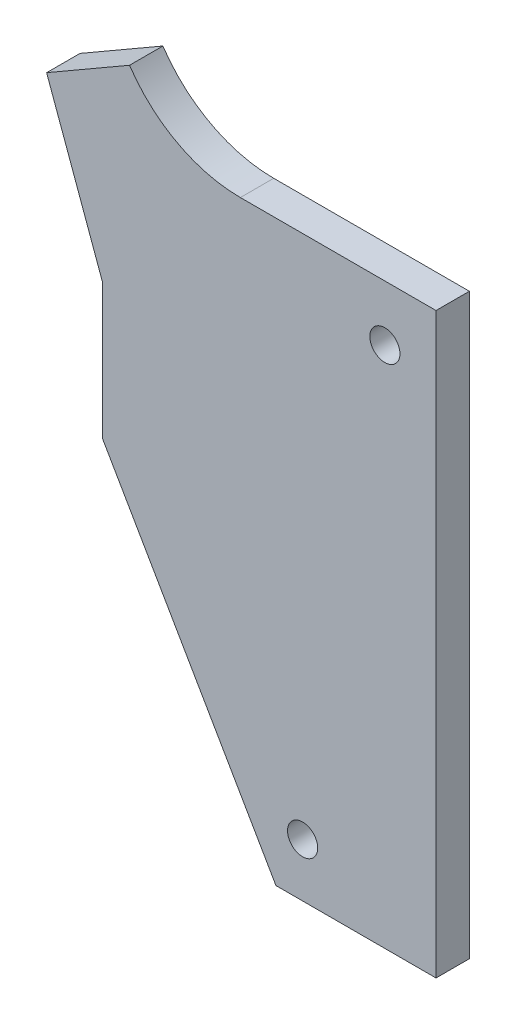
ISO-10303-21;
HEADER;
FILE_DESCRIPTION(('STEP AP214'),'2;1');
FILE_NAME('part.step','',(''),(''),'','','');
FILE_SCHEMA(('AUTOMOTIVE_DESIGN { 1 0 10303 214 1 1 1 1 }'));
ENDSEC;
DATA;
#1=APPLICATION_CONTEXT('core data for automotive mechanical design processes');
#2=APPLICATION_PROTOCOL_DEFINITION('international standard','automotive_design',2000,#1);
#3=PRODUCT_CONTEXT('',#1,'mechanical');
#4=PRODUCT('Part','Part','',(#3));
#5=PRODUCT_RELATED_PRODUCT_CATEGORY('part','',(#4));
#6=PRODUCT_DEFINITION_FORMATION('','',#4);
#7=PRODUCT_DEFINITION_CONTEXT('part definition',#1,'design');
#8=PRODUCT_DEFINITION('design','',#6,#7);
#9=PRODUCT_DEFINITION_SHAPE('','',#8);
#10=(LENGTH_UNIT() NAMED_UNIT(*) SI_UNIT(.MILLI.,.METRE.));
#11=(NAMED_UNIT(*) PLANE_ANGLE_UNIT() SI_UNIT($,.RADIAN.));
#12=(NAMED_UNIT(*) SI_UNIT($,.STERADIAN.) SOLID_ANGLE_UNIT());
#13=UNCERTAINTY_MEASURE_WITH_UNIT(LENGTH_MEASURE(1.E-05),#10,'distance_accuracy_value','');
#14=(GEOMETRIC_REPRESENTATION_CONTEXT(3) GLOBAL_UNCERTAINTY_ASSIGNED_CONTEXT((#13)) GLOBAL_UNIT_ASSIGNED_CONTEXT((#10,
#11,#12)) REPRESENTATION_CONTEXT('',''));
#15=CARTESIAN_POINT('',(0.,0.,0.));
#16=DIRECTION('',(0.,0.,1.));
#17=DIRECTION('',(1.,0.,0.));
#18=AXIS2_PLACEMENT_3D('',#15,#16,#17);
#19=CARTESIAN_POINT('',(-3126.55875717774,1002.34569471236,4.7625));
#20=DIRECTION('',(0.,1.,0.));
#21=DIRECTION('',(0.,0.,1.));
#22=AXIS2_PLACEMENT_3D('',#19,#20,#21);
#23=PLANE('',#22);
#24=DIRECTION('',(1.,0.,0.));
#25=VECTOR('',#24,1.);
#26=CARTESIAN_POINT('',(-3126.55875717774,1002.34569471236,0.));
#27=LINE('',#26,#25);
#28=CARTESIAN_POINT('',(-3126.55875717774,1002.34569471236,0.));
#29=VERTEX_POINT('',#28);
#30=CARTESIAN_POINT('',(-3103.69875717774,1002.34569471236,0.));
#31=VERTEX_POINT('',#30);
#32=EDGE_CURVE('E128',#29,#31,#27,.T.);
#33=ORIENTED_EDGE('',*,*,#32,.T.);
#34=DIRECTION('',(0.,0.,-1.));
#35=VECTOR('',#34,1.);
#36=CARTESIAN_POINT('',(-3103.69875717774,1002.34569471236,4.7625));
#37=LINE('',#36,#35);
#38=CARTESIAN_POINT('',(-3103.69875717774,1002.34569471236,4.7625));
#39=VERTEX_POINT('',#38);
#40=EDGE_CURVE('E11',#39,#31,#37,.T.);
#41=ORIENTED_EDGE('',*,*,#40,.F.);
#42=DIRECTION('',(1.,0.,0.));
#43=VECTOR('',#42,1.);
#44=CARTESIAN_POINT('',(-3126.55875717774,1002.34569471236,4.7625));
#45=LINE('',#44,#43);
#46=CARTESIAN_POINT('',(-3126.55875717774,1002.34569471236,4.7625));
#47=VERTEX_POINT('',#46);
#48=EDGE_CURVE('E143',#47,#39,#45,.T.);
#49=ORIENTED_EDGE('',*,*,#48,.F.);
#50=DIRECTION('',(0.,0.,-1.));
#51=VECTOR('',#50,1.);
#52=CARTESIAN_POINT('',(-3126.55875717774,1002.34569471236,4.7625));
#53=LINE('',#52,#51);
#54=EDGE_CURVE('E124',#47,#29,#53,.T.);
#55=ORIENTED_EDGE('',*,*,#54,.T.);
#56=EDGE_LOOP('',(#33,#41,#49,#55));
#57=FACE_BOUND('',#56,.T.);
#58=ADVANCED_FACE('F32',(#57),#23,.F.);
#59=CARTESIAN_POINT('',(-3103.69875717774,1002.34569471236,4.7625));
#60=DIRECTION('',(-1.,0.,0.));
#61=DIRECTION('',(0.,0.,1.));
#62=AXIS2_PLACEMENT_3D('',#59,#60,#61);
#63=PLANE('',#62);
#64=DIRECTION('',(0.,1.,0.));
#65=VECTOR('',#64,1.);
#66=CARTESIAN_POINT('',(-3103.69875717774,1002.34569471236,0.));
#67=LINE('',#66,#65);
#68=CARTESIAN_POINT('',(-3103.69875717774,1084.89569471236,0.));
#69=VERTEX_POINT('',#68);
#70=EDGE_CURVE('E131',#31,#69,#67,.T.);
#71=ORIENTED_EDGE('',*,*,#70,.T.);
#72=DIRECTION('',(0.,0.,-1.));
#73=VECTOR('',#72,1.);
#74=CARTESIAN_POINT('',(-3103.69875717774,1084.89569471236,4.7625));
#75=LINE('',#74,#73);
#76=CARTESIAN_POINT('',(-3103.69875717774,1084.89569471236,4.7625));
#77=VERTEX_POINT('',#76);
#78=EDGE_CURVE('E40',#77,#69,#75,.T.);
#79=ORIENTED_EDGE('',*,*,#78,.F.);
#80=DIRECTION('',(0.,1.,0.));
#81=VECTOR('',#80,1.);
#82=CARTESIAN_POINT('',(-3103.69875717774,1002.34569471236,4.7625));
#83=LINE('',#82,#81);
#84=EDGE_CURVE('E91',#39,#77,#83,.T.);
#85=ORIENTED_EDGE('',*,*,#84,.F.);
#86=ORIENTED_EDGE('',*,*,#40,.T.);
#87=EDGE_LOOP('',(#71,#79,#85,#86));
#88=FACE_BOUND('',#87,.T.);
#89=ADVANCED_FACE('F210',(#88),#63,.F.);
#90=CARTESIAN_POINT('',(-3103.69875717774,1084.89569471236,4.7625));
#91=DIRECTION('',(0.,-1.,0.));
#92=DIRECTION('',(0.,0.,-1.));
#93=AXIS2_PLACEMENT_3D('',#90,#91,#92);
#94=PLANE('',#93);
#95=DIRECTION('',(-1.,0.,0.));
#96=VECTOR('',#95,1.);
#97=CARTESIAN_POINT('',(-3103.69875717774,1084.89569471236,0.));
#98=LINE('',#97,#96);
#99=CARTESIAN_POINT('',(-3131.63875717774,1084.89569471236,0.));
#100=VERTEX_POINT('',#99);
#101=EDGE_CURVE('E134',#69,#100,#98,.T.);
#102=ORIENTED_EDGE('',*,*,#101,.T.);
#103=DIRECTION('',(0.,0.,-1.));
#104=VECTOR('',#103,1.);
#105=CARTESIAN_POINT('',(-3131.63875717774,1084.89569471236,4.7625));
#106=LINE('',#105,#104);
#107=CARTESIAN_POINT('',(-3131.63875717774,1084.89569471236,4.7625));
#108=VERTEX_POINT('',#107);
#109=EDGE_CURVE('E150',#108,#100,#106,.T.);
#110=ORIENTED_EDGE('',*,*,#109,.F.);
#111=DIRECTION('',(-1.,0.,0.));
#112=VECTOR('',#111,1.);
#113=CARTESIAN_POINT('',(-3103.69875717774,1084.89569471236,4.7625));
#114=LINE('',#113,#112);
#115=EDGE_CURVE('E158',#77,#108,#114,.T.);
#116=ORIENTED_EDGE('',*,*,#115,.F.);
#117=ORIENTED_EDGE('',*,*,#78,.T.);
#118=EDGE_LOOP('',(#102,#110,#116,#117));
#119=FACE_BOUND('',#118,.T.);
#120=ADVANCED_FACE('F156',(#119),#94,.F.);
#121=CARTESIAN_POINT('',(-3131.63875717774,1103.94569471236,4.7625));
#122=DIRECTION('',(0.,0.,-1.));
#123=DIRECTION('',(-1.,0.,0.));
#124=AXIS2_PLACEMENT_3D('',#121,#122,#123);
#125=CYLINDRICAL_SURFACE('',#124,19.0500000000001);
#126=CARTESIAN_POINT('',(-3131.63875717774,1103.94569471236,0.));
#127=DIRECTION('',(0.,0.,-1.));
#128=DIRECTION('',(1.,0.,0.));
#129=AXIS2_PLACEMENT_3D('',#126,#127,#128);
#130=CIRCLE('',#129,19.0500000000001);
#131=CARTESIAN_POINT('',(-3147.4648385517,1093.34203268714,0.));
#132=VERTEX_POINT('',#131);
#133=EDGE_CURVE('E136',#100,#132,#130,.T.);
#134=ORIENTED_EDGE('',*,*,#133,.T.);
#135=DIRECTION('',(0.,0.,-1.));
#136=VECTOR('',#135,1.);
#137=CARTESIAN_POINT('',(-3147.4648385517,1093.34203268714,4.7625));
#138=LINE('',#137,#136);
#139=CARTESIAN_POINT('',(-3147.4648385517,1093.34203268714,4.7625));
#140=VERTEX_POINT('',#139);
#141=EDGE_CURVE('E147',#140,#132,#138,.T.);
#142=ORIENTED_EDGE('',*,*,#141,.F.);
#143=CARTESIAN_POINT('',(-3131.63875717774,1103.94569471236,4.7625));
#144=DIRECTION('',(0.,0.,-1.));
#145=DIRECTION('',(1.,0.,0.));
#146=AXIS2_PLACEMENT_3D('',#143,#144,#145);
#147=CIRCLE('',#146,19.0500000000001);
#148=EDGE_CURVE('E170',#108,#140,#147,.T.);
#149=ORIENTED_EDGE('',*,*,#148,.F.);
#150=ORIENTED_EDGE('',*,*,#109,.T.);
#151=EDGE_LOOP('',(#134,#142,#149,#150));
#152=FACE_BOUND('',#151,.T.);
#153=ADVANCED_FACE('F166',(#152),#125,.F.);
#154=CARTESIAN_POINT('',(-3147.4648385517,1093.34203268714,4.7625));
#155=DIRECTION('',(0.500000000000015,-0.86602540378443,0.));
#156=DIRECTION('',(0.86602540378443,0.500000000000015,0.));
#157=AXIS2_PLACEMENT_3D('',#154,#155,#156);
#158=PLANE('',#157);
#159=DIRECTION('',(-0.86602540378443,-0.500000000000015,0.));
#160=VECTOR('',#159,1.);
#161=CARTESIAN_POINT('',(-3147.4648385517,1093.34203268714,0.));
#162=LINE('',#161,#160);
#163=CARTESIAN_POINT('',(-3159.30564157972,1086.50574187149,0.));
#164=VERTEX_POINT('',#163);
#165=EDGE_CURVE('E138',#132,#164,#162,.T.);
#166=ORIENTED_EDGE('',*,*,#165,.T.);
#167=DIRECTION('',(0.,0.,-1.));
#168=VECTOR('',#167,1.);
#169=CARTESIAN_POINT('',(-3159.30564157972,1086.50574187149,4.7625));
#170=LINE('',#169,#168);
#171=CARTESIAN_POINT('',(-3159.30564157972,1086.50574187149,4.7625));
#172=VERTEX_POINT('',#171);
#173=EDGE_CURVE('E119',#172,#164,#170,.T.);
#174=ORIENTED_EDGE('',*,*,#173,.F.);
#175=DIRECTION('',(-0.86602540378443,-0.500000000000015,0.));
#176=VECTOR('',#175,1.);
#177=CARTESIAN_POINT('',(-3147.4648385517,1093.34203268714,4.7625));
#178=LINE('',#177,#176);
#179=EDGE_CURVE('E110',#140,#172,#178,.T.);
#180=ORIENTED_EDGE('',*,*,#179,.F.);
#181=ORIENTED_EDGE('',*,*,#141,.T.);
#182=EDGE_LOOP('',(#166,#174,#180,#181));
#183=FACE_BOUND('',#182,.T.);
#184=ADVANCED_FACE('F169',(#183),#158,.F.);
#185=CARTESIAN_POINT('',(-3159.30564157972,1086.50574187149,4.7625));
#186=DIRECTION('',(0.939692620785912,0.34202014332566,0.));
#187=DIRECTION('',(-0.34202014332566,0.939692620785912,0.));
#188=AXIS2_PLACEMENT_3D('',#185,#186,#187);
#189=PLANE('',#188);
#190=DIRECTION('',(0.34202014332566,-0.939692620785912,0.));
#191=VECTOR('',#190,1.);
#192=CARTESIAN_POINT('',(-3159.30564157972,1086.50574187149,0.));
#193=LINE('',#192,#191);
#194=CARTESIAN_POINT('',(-3151.32375717774,1064.57569471236,0.));
#195=VERTEX_POINT('',#194);
#196=EDGE_CURVE('E118',#164,#195,#193,.T.);
#197=ORIENTED_EDGE('',*,*,#196,.T.);
#198=DIRECTION('',(0.,0.,-1.));
#199=VECTOR('',#198,1.);
#200=CARTESIAN_POINT('',(-3151.32375717774,1064.57569471236,4.7625));
#201=LINE('',#200,#199);
#202=CARTESIAN_POINT('',(-3151.32375717774,1064.57569471236,4.7625));
#203=VERTEX_POINT('',#202);
#204=EDGE_CURVE('E115',#203,#195,#201,.T.);
#205=ORIENTED_EDGE('',*,*,#204,.F.);
#206=DIRECTION('',(0.34202014332566,-0.939692620785912,0.));
#207=VECTOR('',#206,1.);
#208=CARTESIAN_POINT('',(-3159.30564157972,1086.50574187149,4.7625));
#209=LINE('',#208,#207);
#210=EDGE_CURVE('E104',#172,#203,#209,.T.);
#211=ORIENTED_EDGE('',*,*,#210,.F.);
#212=ORIENTED_EDGE('',*,*,#173,.T.);
#213=EDGE_LOOP('',(#197,#205,#211,#212));
#214=FACE_BOUND('',#213,.T.);
#215=ADVANCED_FACE('F116',(#214),#189,.F.);
#216=CARTESIAN_POINT('',(-3151.32375717774,1064.57569471236,4.7625));
#217=DIRECTION('',(1.,0.,0.));
#218=DIRECTION('',(0.,0.,-1.));
#219=AXIS2_PLACEMENT_3D('',#216,#217,#218);
#220=PLANE('',#219);
#221=DIRECTION('',(0.,-1.,0.));
#222=VECTOR('',#221,1.);
#223=CARTESIAN_POINT('',(-3151.32375717774,1064.57569471236,0.));
#224=LINE('',#223,#222);
#225=CARTESIAN_POINT('',(-3151.32375717774,1045.2399329618,0.));
#226=VERTEX_POINT('',#225);
#227=EDGE_CURVE('E77',#195,#226,#224,.T.);
#228=ORIENTED_EDGE('',*,*,#227,.T.);
#229=DIRECTION('',(0.,0.,-1.));
#230=VECTOR('',#229,1.);
#231=CARTESIAN_POINT('',(-3151.32375717774,1045.2399329618,4.7625));
#232=LINE('',#231,#230);
#233=CARTESIAN_POINT('',(-3151.32375717774,1045.2399329618,4.7625));
#234=VERTEX_POINT('',#233);
#235=EDGE_CURVE('E120',#234,#226,#232,.T.);
#236=ORIENTED_EDGE('',*,*,#235,.F.);
#237=DIRECTION('',(0.,-1.,0.));
#238=VECTOR('',#237,1.);
#239=CARTESIAN_POINT('',(-3151.32375717774,1064.57569471236,4.7625));
#240=LINE('',#239,#238);
#241=EDGE_CURVE('E108',#203,#234,#240,.T.);
#242=ORIENTED_EDGE('',*,*,#241,.F.);
#243=ORIENTED_EDGE('',*,*,#204,.T.);
#244=EDGE_LOOP('',(#228,#236,#242,#243));
#245=FACE_BOUND('',#244,.T.);
#246=ADVANCED_FACE('F122',(#245),#220,.F.);
#247=CARTESIAN_POINT('',(-3151.32375717774,1045.2399329618,4.7625));
#248=DIRECTION('',(0.866025403784439,0.499999999999999,0.));
#249=DIRECTION('',(-0.499999999999999,0.86602540378444,0.));
#250=AXIS2_PLACEMENT_3D('',#247,#248,#249);
#251=PLANE('',#250);
#252=DIRECTION('',(0.499999999999999,-0.866025403784439,0.));
#253=VECTOR('',#252,1.);
#254=CARTESIAN_POINT('',(-3151.32375717774,1045.2399329618,0.));
#255=LINE('',#254,#253);
#256=EDGE_CURVE('E83',#226,#29,#255,.T.);
#257=ORIENTED_EDGE('',*,*,#256,.T.);
#258=ORIENTED_EDGE('',*,*,#54,.F.);
#259=DIRECTION('',(0.499999999999999,-0.866025403784439,0.));
#260=VECTOR('',#259,1.);
#261=CARTESIAN_POINT('',(-3151.32375717774,1045.2399329618,4.7625));
#262=LINE('',#261,#260);
#263=EDGE_CURVE('E48',#234,#47,#262,.T.);
#264=ORIENTED_EDGE('',*,*,#263,.F.);
#265=ORIENTED_EDGE('',*,*,#235,.T.);
#266=EDGE_LOOP('',(#257,#258,#264,#265));
#267=FACE_BOUND('',#266,.T.);
#268=ADVANCED_FACE('F192',(#267),#251,.F.);
#269=CARTESIAN_POINT('',(-3131.63875717774,1103.94569471236,4.7625));
#270=DIRECTION('',(0.,0.,1.));
#271=DIRECTION('',(1.,0.,0.));
#272=AXIS2_PLACEMENT_3D('',#269,#270,#271);
#273=PLANE('',#272);
#274=CARTESIAN_POINT('',(-3122.74875717774,1009.96569471236,4.7625));
#275=DIRECTION('',(0.,0.,1.));
#276=DIRECTION('',(1.,0.,0.));
#277=AXIS2_PLACEMENT_3D('',#274,#275,#276);
#278=CIRCLE('',#277,2.1526500000002);
#279=CARTESIAN_POINT('',(-3120.59610717774,1009.96569471236,4.7625));
#280=VERTEX_POINT('',#279);
#281=EDGE_CURVE('E184',#280,#280,#278,.T.);
#282=ORIENTED_EDGE('',*,*,#281,.F.);
#283=EDGE_LOOP('',(#282));
#284=FACE_BOUND('',#283,.T.);
#285=CARTESIAN_POINT('',(-3111.00125717774,1076.95819471236,4.7625));
#286=DIRECTION('',(0.,0.,1.));
#287=DIRECTION('',(1.,0.,0.));
#288=AXIS2_PLACEMENT_3D('',#285,#286,#287);
#289=CIRCLE('',#288,2.1526500000002);
#290=CARTESIAN_POINT('',(-3108.84860717774,1076.95819471236,4.7625));
#291=VERTEX_POINT('',#290);
#292=EDGE_CURVE('E178',#291,#291,#289,.T.);
#293=ORIENTED_EDGE('',*,*,#292,.F.);
#294=EDGE_LOOP('',(#293));
#295=FACE_BOUND('',#294,.T.);
#296=ORIENTED_EDGE('',*,*,#48,.T.);
#297=ORIENTED_EDGE('',*,*,#84,.T.);
#298=ORIENTED_EDGE('',*,*,#115,.T.);
#299=ORIENTED_EDGE('',*,*,#148,.T.);
#300=ORIENTED_EDGE('',*,*,#179,.T.);
#301=ORIENTED_EDGE('',*,*,#210,.T.);
#302=ORIENTED_EDGE('',*,*,#241,.T.);
#303=ORIENTED_EDGE('',*,*,#263,.T.);
#304=EDGE_LOOP('',(#296,#297,#298,#299,#300,#301,#302,#303));
#305=FACE_BOUND('',#304,.T.);
#306=ADVANCED_FACE('F106',(#284,#295,#305),#273,.T.);
#307=CARTESIAN_POINT('',(-3131.63875717774,1103.94569471236,0.));
#308=DIRECTION('',(0.,0.,1.));
#309=DIRECTION('',(1.,0.,0.));
#310=AXIS2_PLACEMENT_3D('',#307,#308,#309);
#311=PLANE('',#310);
#312=CARTESIAN_POINT('',(-3122.74875717774,1009.96569471236,0.));
#313=DIRECTION('',(0.,0.,1.));
#314=DIRECTION('',(1.,0.,0.));
#315=AXIS2_PLACEMENT_3D('',#312,#313,#314);
#316=CIRCLE('',#315,2.1526500000002);
#317=CARTESIAN_POINT('',(-3120.59610717774,1009.96569471236,0.));
#318=VERTEX_POINT('',#317);
#319=EDGE_CURVE('E181',#318,#318,#316,.T.);
#320=ORIENTED_EDGE('',*,*,#319,.T.);
#321=EDGE_LOOP('',(#320));
#322=FACE_BOUND('',#321,.T.);
#323=CARTESIAN_POINT('',(-3111.00125717774,1076.95819471236,0.));
#324=DIRECTION('',(0.,0.,1.));
#325=DIRECTION('',(1.,0.,0.));
#326=AXIS2_PLACEMENT_3D('',#323,#324,#325);
#327=CIRCLE('',#326,2.1526500000002);
#328=CARTESIAN_POINT('',(-3108.84860717774,1076.95819471236,0.));
#329=VERTEX_POINT('',#328);
#330=EDGE_CURVE('E132',#329,#329,#327,.T.);
#331=ORIENTED_EDGE('',*,*,#330,.T.);
#332=EDGE_LOOP('',(#331));
#333=FACE_BOUND('',#332,.T.);
#334=ORIENTED_EDGE('',*,*,#32,.F.);
#335=ORIENTED_EDGE('',*,*,#256,.F.);
#336=ORIENTED_EDGE('',*,*,#227,.F.);
#337=ORIENTED_EDGE('',*,*,#196,.F.);
#338=ORIENTED_EDGE('',*,*,#165,.F.);
#339=ORIENTED_EDGE('',*,*,#133,.F.);
#340=ORIENTED_EDGE('',*,*,#101,.F.);
#341=ORIENTED_EDGE('',*,*,#70,.F.);
#342=EDGE_LOOP('',(#334,#335,#336,#337,#338,#339,#340,#341));
#343=FACE_BOUND('',#342,.T.);
#344=ADVANCED_FACE('F162',(#322,#333,#343),#311,.F.);
#345=CARTESIAN_POINT('',(-3111.00125717774,1076.95819471236,4.7625));
#346=DIRECTION('',(0.,0.,1.));
#347=DIRECTION('',(1.,0.,0.));
#348=AXIS2_PLACEMENT_3D('',#345,#346,#347);
#349=CYLINDRICAL_SURFACE('',#348,2.1526500000002);
#350=ORIENTED_EDGE('',*,*,#330,.F.);
#351=EDGE_LOOP('',(#350));
#352=FACE_BOUND('',#351,.T.);
#353=ORIENTED_EDGE('',*,*,#292,.T.);
#354=EDGE_LOOP('',(#353));
#355=FACE_BOUND('',#354,.T.);
#356=ADVANCED_FACE('F196',(#352,#355),#349,.F.);
#357=CARTESIAN_POINT('',(-3122.74875717774,1009.96569471236,4.7625));
#358=DIRECTION('',(0.,0.,1.));
#359=DIRECTION('',(1.,0.,0.));
#360=AXIS2_PLACEMENT_3D('',#357,#358,#359);
#361=CYLINDRICAL_SURFACE('',#360,2.1526500000002);
#362=ORIENTED_EDGE('',*,*,#319,.F.);
#363=EDGE_LOOP('',(#362));
#364=FACE_BOUND('',#363,.T.);
#365=ORIENTED_EDGE('',*,*,#281,.T.);
#366=EDGE_LOOP('',(#365));
#367=FACE_BOUND('',#366,.T.);
#368=ADVANCED_FACE('F188',(#364,#367),#361,.F.);
#369=CLOSED_SHELL('',(#58,#89,#120,#153,#184,#215,#246,#268,#306,#344,#356,#368));
#370=MANIFOLD_SOLID_BREP('B2',#369);
#371=ADVANCED_BREP_SHAPE_REPRESENTATION('',(#18,#370),#14);
#372=SHAPE_DEFINITION_REPRESENTATION(#9,#371);
ENDSEC;
END-ISO-10303-21;
